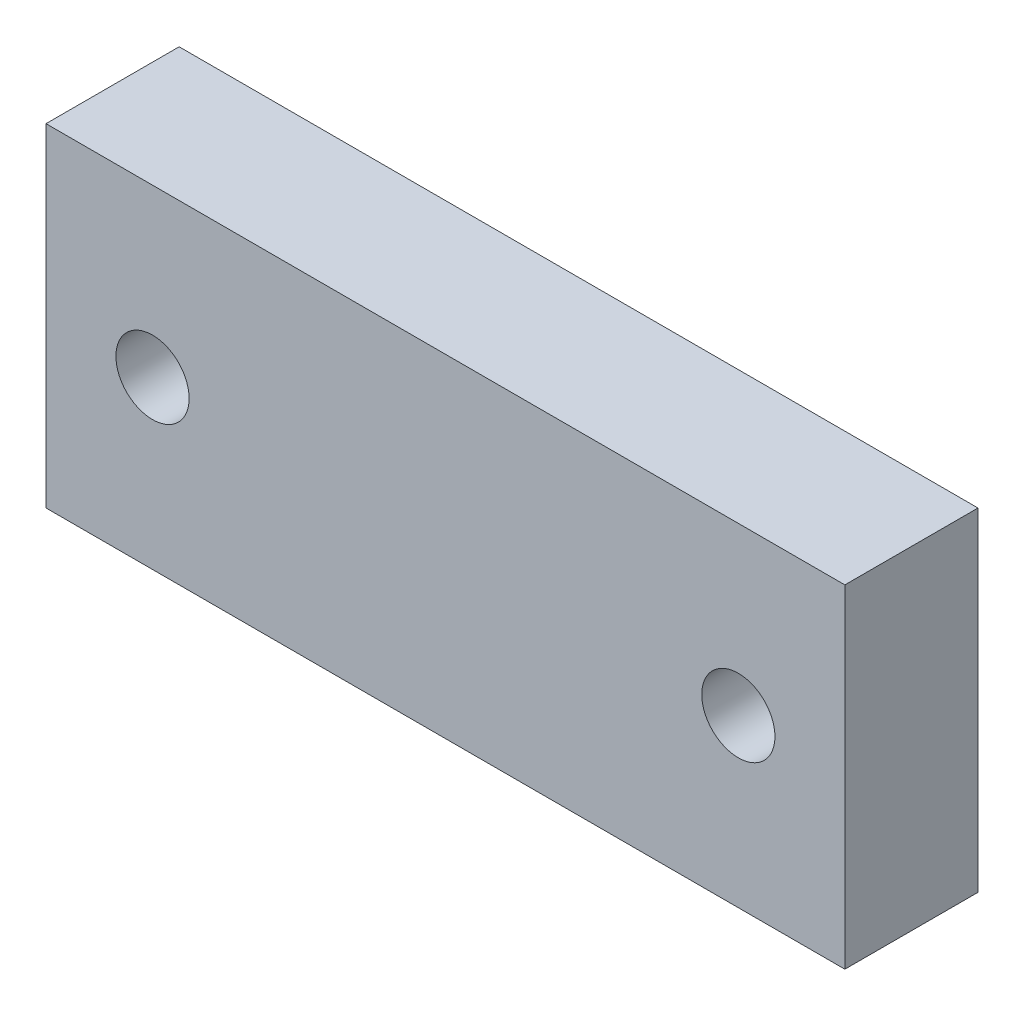
ISO-10303-21;
HEADER;
FILE_DESCRIPTION(('STEP AP214'),'2;1');
FILE_NAME('part.step','',(''),(''),'','','');
FILE_SCHEMA(('AUTOMOTIVE_DESIGN { 1 0 10303 214 1 1 1 1 }'));
ENDSEC;
DATA;
#1=APPLICATION_CONTEXT('core data for automotive mechanical design processes');
#2=APPLICATION_PROTOCOL_DEFINITION('international standard','automotive_design',2000,#1);
#3=PRODUCT_CONTEXT('',#1,'mechanical');
#4=PRODUCT('Part','Part','',(#3));
#5=PRODUCT_RELATED_PRODUCT_CATEGORY('part','',(#4));
#6=PRODUCT_DEFINITION_FORMATION('','',#4);
#7=PRODUCT_DEFINITION_CONTEXT('part definition',#1,'design');
#8=PRODUCT_DEFINITION('design','',#6,#7);
#9=PRODUCT_DEFINITION_SHAPE('','',#8);
#10=(LENGTH_UNIT() NAMED_UNIT(*) SI_UNIT(.MILLI.,.METRE.));
#11=(NAMED_UNIT(*) PLANE_ANGLE_UNIT() SI_UNIT($,.RADIAN.));
#12=(NAMED_UNIT(*) SI_UNIT($,.STERADIAN.) SOLID_ANGLE_UNIT());
#13=UNCERTAINTY_MEASURE_WITH_UNIT(LENGTH_MEASURE(1.E-05),#10,'distance_accuracy_value','');
#14=(GEOMETRIC_REPRESENTATION_CONTEXT(3) GLOBAL_UNCERTAINTY_ASSIGNED_CONTEXT((#13)) GLOBAL_UNIT_ASSIGNED_CONTEXT((#10,
#11,#12)) REPRESENTATION_CONTEXT('',''));
#15=CARTESIAN_POINT('',(0.,0.,0.));
#16=DIRECTION('',(0.,0.,1.));
#17=DIRECTION('',(1.,0.,0.));
#18=AXIS2_PLACEMENT_3D('',#15,#16,#17);
#19=CARTESIAN_POINT('',(0.,0.,10.));
#20=DIRECTION('',(0.,0.,1.));
#21=DIRECTION('',(1.,0.,0.));
#22=AXIS2_PLACEMENT_3D('',#19,#20,#21);
#23=PLANE('',#22);
#24=CARTESIAN_POINT('',(-5.00392385005286,5.50121041957288,10.));
#25=DIRECTION('',(0.,0.,1.));
#26=DIRECTION('',(1.,0.,0.));
#27=AXIS2_PLACEMENT_3D('',#24,#25,#26);
#28=CIRCLE('',#27,2.75);
#29=CARTESIAN_POINT('',(-2.25392385005286,5.50121041957288,10.));
#30=VERTEX_POINT('',#29);
#31=EDGE_CURVE('E112',#30,#30,#28,.T.);
#32=ORIENTED_EDGE('',*,*,#31,.F.);
#33=EDGE_LOOP('',(#32));
#34=FACE_BOUND('',#33,.T.);
#35=DIRECTION('',(0.,-1.,0.));
#36=VECTOR('',#35,1.);
#37=CARTESIAN_POINT('',(-13.0039238500529,18.0012104195729,10.));
#38=LINE('',#37,#36);
#39=CARTESIAN_POINT('',(-13.0039238500529,18.0012104195729,10.));
#40=VERTEX_POINT('',#39);
#41=CARTESIAN_POINT('',(-13.0039238500529,-6.99878958042712,10.));
#42=VERTEX_POINT('',#41);
#43=EDGE_CURVE('E92',#40,#42,#38,.T.);
#44=ORIENTED_EDGE('',*,*,#43,.T.);
#45=DIRECTION('',(1.,0.,0.));
#46=VECTOR('',#45,1.);
#47=CARTESIAN_POINT('',(-13.0039238500529,-6.99878958042712,10.));
#48=LINE('',#47,#46);
#49=CARTESIAN_POINT('',(46.9960761499471,-6.99878958042712,10.));
#50=VERTEX_POINT('',#49);
#51=EDGE_CURVE('E87',#42,#50,#48,.T.);
#52=ORIENTED_EDGE('',*,*,#51,.T.);
#53=DIRECTION('',(0.,1.,0.));
#54=VECTOR('',#53,1.);
#55=CARTESIAN_POINT('',(46.9960761499471,18.0012104195729,10.));
#56=LINE('',#55,#54);
#57=CARTESIAN_POINT('',(46.9960761499471,18.0012104195729,10.));
#58=VERTEX_POINT('',#57);
#59=EDGE_CURVE('E90',#50,#58,#56,.T.);
#60=ORIENTED_EDGE('',*,*,#59,.T.);
#61=DIRECTION('',(-1.,0.,0.));
#62=VECTOR('',#61,1.);
#63=CARTESIAN_POINT('',(-13.0039238500529,18.0012104195729,10.));
#64=LINE('',#63,#62);
#65=EDGE_CURVE('E57',#58,#40,#64,.T.);
#66=ORIENTED_EDGE('',*,*,#65,.T.);
#67=EDGE_LOOP('',(#44,#52,#60,#66));
#68=FACE_BOUND('',#67,.T.);
#69=CARTESIAN_POINT('',(38.9960761499471,5.50121041957288,10.));
#70=DIRECTION('',(0.,0.,1.));
#71=DIRECTION('',(1.,0.,0.));
#72=AXIS2_PLACEMENT_3D('',#69,#70,#71);
#73=CIRCLE('',#72,2.74999999999999);
#74=CARTESIAN_POINT('',(41.7460761499471,5.50121041957288,10.));
#75=VERTEX_POINT('',#74);
#76=EDGE_CURVE('E134',#75,#75,#73,.T.);
#77=ORIENTED_EDGE('',*,*,#76,.F.);
#78=EDGE_LOOP('',(#77));
#79=FACE_BOUND('',#78,.T.);
#80=ADVANCED_FACE('F39',(#34,#68,#79),#23,.T.);
#81=CARTESIAN_POINT('',(0.,0.,0.));
#82=DIRECTION('',(0.,0.,1.));
#83=DIRECTION('',(1.,0.,0.));
#84=AXIS2_PLACEMENT_3D('',#81,#82,#83);
#85=PLANE('',#84);
#86=DIRECTION('',(0.,-1.,0.));
#87=VECTOR('',#86,1.);
#88=CARTESIAN_POINT('',(-13.0039238500529,18.0012104195729,0.));
#89=LINE('',#88,#87);
#90=CARTESIAN_POINT('',(-13.0039238500529,18.0012104195729,0.));
#91=VERTEX_POINT('',#90);
#92=CARTESIAN_POINT('',(-13.0039238500529,-6.99878958042712,0.));
#93=VERTEX_POINT('',#92);
#94=EDGE_CURVE('E108',#91,#93,#89,.T.);
#95=ORIENTED_EDGE('',*,*,#94,.F.);
#96=DIRECTION('',(-1.,0.,0.));
#97=VECTOR('',#96,1.);
#98=CARTESIAN_POINT('',(-13.0039238500529,18.0012104195729,0.));
#99=LINE('',#98,#97);
#100=CARTESIAN_POINT('',(46.9960761499471,18.0012104195729,0.));
#101=VERTEX_POINT('',#100);
#102=EDGE_CURVE('E80',#101,#91,#99,.T.);
#103=ORIENTED_EDGE('',*,*,#102,.F.);
#104=DIRECTION('',(0.,1.,0.));
#105=VECTOR('',#104,1.);
#106=CARTESIAN_POINT('',(46.9960761499471,18.0012104195729,0.));
#107=LINE('',#106,#105);
#108=CARTESIAN_POINT('',(46.9960761499471,-6.99878958042712,0.));
#109=VERTEX_POINT('',#108);
#110=EDGE_CURVE('E74',#109,#101,#107,.T.);
#111=ORIENTED_EDGE('',*,*,#110,.F.);
#112=DIRECTION('',(1.,0.,0.));
#113=VECTOR('',#112,1.);
#114=CARTESIAN_POINT('',(-13.0039238500529,-6.99878958042712,0.));
#115=LINE('',#114,#113);
#116=EDGE_CURVE('E97',#93,#109,#115,.T.);
#117=ORIENTED_EDGE('',*,*,#116,.F.);
#118=EDGE_LOOP('',(#95,#103,#111,#117));
#119=FACE_BOUND('',#118,.T.);
#120=CARTESIAN_POINT('',(-5.00392385005286,5.50121041957288,0.));
#121=DIRECTION('',(0.,0.,1.));
#122=DIRECTION('',(1.,0.,0.));
#123=AXIS2_PLACEMENT_3D('',#120,#121,#122);
#124=CIRCLE('',#123,2.75);
#125=CARTESIAN_POINT('',(-2.25392385005286,5.50121041957288,0.));
#126=VERTEX_POINT('',#125);
#127=EDGE_CURVE('E130',#126,#126,#124,.T.);
#128=ORIENTED_EDGE('',*,*,#127,.T.);
#129=EDGE_LOOP('',(#128));
#130=FACE_BOUND('',#129,.T.);
#131=CARTESIAN_POINT('',(38.9960761499471,5.50121041957288,0.));
#132=DIRECTION('',(0.,0.,1.));
#133=DIRECTION('',(1.,0.,0.));
#134=AXIS2_PLACEMENT_3D('',#131,#132,#133);
#135=CIRCLE('',#134,2.74999999999999);
#136=CARTESIAN_POINT('',(41.7460761499471,5.50121041957288,0.));
#137=VERTEX_POINT('',#136);
#138=EDGE_CURVE('E138',#137,#137,#135,.T.);
#139=ORIENTED_EDGE('',*,*,#138,.T.);
#140=EDGE_LOOP('',(#139));
#141=FACE_BOUND('',#140,.T.);
#142=ADVANCED_FACE('F125',(#119,#130,#141),#85,.F.);
#143=CARTESIAN_POINT('',(-13.0039238500529,18.0012104195729,10.));
#144=DIRECTION('',(1.,0.,0.));
#145=DIRECTION('',(0.,1.,0.));
#146=AXIS2_PLACEMENT_3D('',#143,#144,#145);
#147=PLANE('',#146);
#148=ORIENTED_EDGE('',*,*,#94,.T.);
#149=DIRECTION('',(0.,0.,-1.));
#150=VECTOR('',#149,1.);
#151=CARTESIAN_POINT('',(-13.0039238500529,-6.99878958042712,10.));
#152=LINE('',#151,#150);
#153=EDGE_CURVE('E11',#42,#93,#152,.T.);
#154=ORIENTED_EDGE('',*,*,#153,.F.);
#155=ORIENTED_EDGE('',*,*,#43,.F.);
#156=DIRECTION('',(0.,0.,-1.));
#157=VECTOR('',#156,1.);
#158=CARTESIAN_POINT('',(-13.0039238500529,18.0012104195729,10.));
#159=LINE('',#158,#157);
#160=EDGE_CURVE('E104',#40,#91,#159,.T.);
#161=ORIENTED_EDGE('',*,*,#160,.T.);
#162=EDGE_LOOP('',(#148,#154,#155,#161));
#163=FACE_BOUND('',#162,.T.);
#164=ADVANCED_FACE('F41',(#163),#147,.F.);
#165=CARTESIAN_POINT('',(-13.0039238500529,-6.99878958042712,10.));
#166=DIRECTION('',(0.,1.,0.));
#167=DIRECTION('',(0.,0.,1.));
#168=AXIS2_PLACEMENT_3D('',#165,#166,#167);
#169=PLANE('',#168);
#170=ORIENTED_EDGE('',*,*,#116,.T.);
#171=DIRECTION('',(0.,0.,-1.));
#172=VECTOR('',#171,1.);
#173=CARTESIAN_POINT('',(46.9960761499471,-6.99878958042712,10.));
#174=LINE('',#173,#172);
#175=EDGE_CURVE('E49',#50,#109,#174,.T.);
#176=ORIENTED_EDGE('',*,*,#175,.F.);
#177=ORIENTED_EDGE('',*,*,#51,.F.);
#178=ORIENTED_EDGE('',*,*,#153,.T.);
#179=EDGE_LOOP('',(#170,#176,#177,#178));
#180=FACE_BOUND('',#179,.T.);
#181=ADVANCED_FACE('F96',(#180),#169,.F.);
#182=CARTESIAN_POINT('',(46.9960761499471,18.0012104195729,10.));
#183=DIRECTION('',(-1.,0.,0.));
#184=DIRECTION('',(0.,0.,1.));
#185=AXIS2_PLACEMENT_3D('',#182,#183,#184);
#186=PLANE('',#185);
#187=ORIENTED_EDGE('',*,*,#110,.T.);
#188=DIRECTION('',(0.,0.,-1.));
#189=VECTOR('',#188,1.);
#190=CARTESIAN_POINT('',(46.9960761499471,18.0012104195729,10.));
#191=LINE('',#190,#189);
#192=EDGE_CURVE('E99',#58,#101,#191,.T.);
#193=ORIENTED_EDGE('',*,*,#192,.F.);
#194=ORIENTED_EDGE('',*,*,#59,.F.);
#195=ORIENTED_EDGE('',*,*,#175,.T.);
#196=EDGE_LOOP('',(#187,#193,#194,#195));
#197=FACE_BOUND('',#196,.T.);
#198=ADVANCED_FACE('F100',(#197),#186,.F.);
#199=CARTESIAN_POINT('',(-13.0039238500529,18.0012104195729,10.));
#200=DIRECTION('',(0.,-1.,0.));
#201=DIRECTION('',(0.,0.,-1.));
#202=AXIS2_PLACEMENT_3D('',#199,#200,#201);
#203=PLANE('',#202);
#204=ORIENTED_EDGE('',*,*,#102,.T.);
#205=ORIENTED_EDGE('',*,*,#160,.F.);
#206=ORIENTED_EDGE('',*,*,#65,.F.);
#207=ORIENTED_EDGE('',*,*,#192,.T.);
#208=EDGE_LOOP('',(#204,#205,#206,#207));
#209=FACE_BOUND('',#208,.T.);
#210=ADVANCED_FACE('F122',(#209),#203,.F.);
#211=CARTESIAN_POINT('',(-5.00392385005286,5.50121041957288,10.));
#212=DIRECTION('',(0.,0.,-1.));
#213=DIRECTION('',(-1.,0.,0.));
#214=AXIS2_PLACEMENT_3D('',#211,#212,#213);
#215=CYLINDRICAL_SURFACE('',#214,2.75);
#216=ORIENTED_EDGE('',*,*,#31,.T.);
#217=EDGE_LOOP('',(#216));
#218=FACE_BOUND('',#217,.T.);
#219=ORIENTED_EDGE('',*,*,#127,.F.);
#220=EDGE_LOOP('',(#219));
#221=FACE_BOUND('',#220,.T.);
#222=ADVANCED_FACE('F157',(#218,#221),#215,.F.);
#223=CARTESIAN_POINT('',(38.9960761499471,5.50121041957288,10.));
#224=DIRECTION('',(0.,0.,-1.));
#225=DIRECTION('',(-1.,0.,0.));
#226=AXIS2_PLACEMENT_3D('',#223,#224,#225);
#227=CYLINDRICAL_SURFACE('',#226,2.74999999999999);
#228=ORIENTED_EDGE('',*,*,#76,.T.);
#229=EDGE_LOOP('',(#228));
#230=FACE_BOUND('',#229,.T.);
#231=ORIENTED_EDGE('',*,*,#138,.F.);
#232=EDGE_LOOP('',(#231));
#233=FACE_BOUND('',#232,.T.);
#234=ADVANCED_FACE('F146',(#230,#233),#227,.F.);
#235=CLOSED_SHELL('',(#80,#142,#164,#181,#198,#210,#222,#234));
#236=MANIFOLD_SOLID_BREP('B2',#235);
#237=ADVANCED_BREP_SHAPE_REPRESENTATION('',(#18,#236),#14);
#238=SHAPE_DEFINITION_REPRESENTATION(#9,#237);
ENDSEC;
END-ISO-10303-21;
